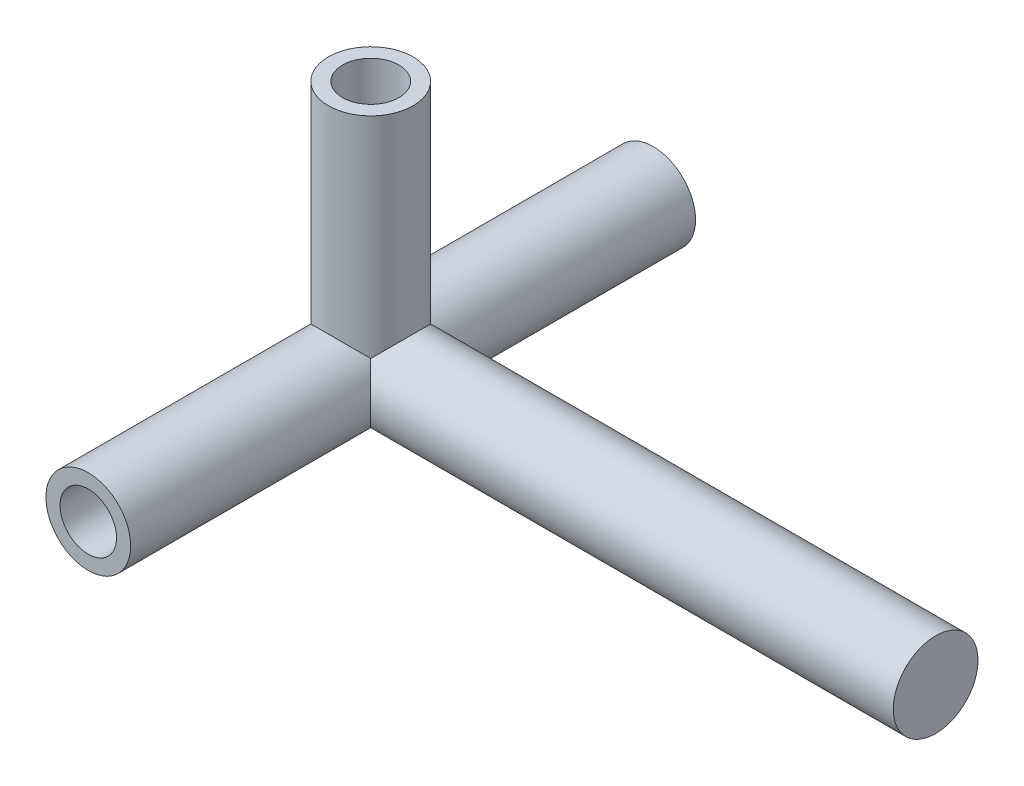
ISO-10303-21;
HEADER;
FILE_DESCRIPTION(('STEP AP214'),'2;1');
FILE_NAME('part.step','',(''),(''),'','','');
FILE_SCHEMA(('AUTOMOTIVE_DESIGN { 1 0 10303 214 1 1 1 1 }'));
ENDSEC;
DATA;
#1=APPLICATION_CONTEXT('core data for automotive mechanical design processes');
#2=APPLICATION_PROTOCOL_DEFINITION('international standard','automotive_design',2000,#1);
#3=PRODUCT_CONTEXT('',#1,'mechanical');
#4=PRODUCT('Part','Part','',(#3));
#5=PRODUCT_RELATED_PRODUCT_CATEGORY('part','',(#4));
#6=PRODUCT_DEFINITION_FORMATION('','',#4);
#7=PRODUCT_DEFINITION_CONTEXT('part definition',#1,'design');
#8=PRODUCT_DEFINITION('design','',#6,#7);
#9=PRODUCT_DEFINITION_SHAPE('','',#8);
#10=(LENGTH_UNIT() NAMED_UNIT(*) SI_UNIT(.MILLI.,.METRE.));
#11=(NAMED_UNIT(*) PLANE_ANGLE_UNIT() SI_UNIT($,.RADIAN.));
#12=(NAMED_UNIT(*) SI_UNIT($,.STERADIAN.) SOLID_ANGLE_UNIT());
#13=UNCERTAINTY_MEASURE_WITH_UNIT(LENGTH_MEASURE(1.E-05),#10,'distance_accuracy_value','');
#14=(GEOMETRIC_REPRESENTATION_CONTEXT(3) GLOBAL_UNCERTAINTY_ASSIGNED_CONTEXT((#13)) GLOBAL_UNIT_ASSIGNED_CONTEXT((#10,
#11,#12)) REPRESENTATION_CONTEXT('',''));
#15=CARTESIAN_POINT('',(0.,0.,0.));
#16=DIRECTION('',(0.,0.,1.));
#17=DIRECTION('',(1.,0.,0.));
#18=AXIS2_PLACEMENT_3D('',#15,#16,#17);
#19=CARTESIAN_POINT('',(0.,0.,0.));
#20=DIRECTION('',(0.,1.,0.));
#21=DIRECTION('',(0.,0.,1.));
#22=AXIS2_PLACEMENT_3D('',#19,#20,#21);
#23=CYLINDRICAL_SURFACE('',#22,3.75);
#24=CARTESIAN_POINT('',(0.,21.25,0.));
#25=DIRECTION('',(0.,1.,0.));
#26=DIRECTION('',(0.,0.,1.));
#27=AXIS2_PLACEMENT_3D('',#24,#25,#26);
#28=CIRCLE('',#27,3.75);
#29=CARTESIAN_POINT('',(0.,21.25,3.75));
#30=VERTEX_POINT('',#29);
#31=EDGE_CURVE('E90',#30,#30,#28,.T.);
#32=ORIENTED_EDGE('',*,*,#31,.F.);
#33=EDGE_LOOP('',(#32));
#34=FACE_BOUND('',#33,.T.);
#35=CARTESIAN_POINT('',(-3.75,0.,0.));
#36=CARTESIAN_POINT('',(-3.75000005696414,0.0492651044086286,0.0492680009212414));
#37=CARTESIAN_POINT('',(-3.74902907021602,0.0985208451068601,0.0985452437469612));
#38=CARTESIAN_POINT('',(-3.74538782347,0.190796713683162,0.190857540662846));
#39=CARTESIAN_POINT('',(-3.74294688985675,0.233821171485445,0.233897411757015));
#40=CARTESIAN_POINT('',(-3.73703721652419,0.31363592807218,0.313712226517568));
#41=CARTESIAN_POINT('',(-3.73376715536458,0.350431579680017,0.35049663495009));
#42=CARTESIAN_POINT('',(-3.726122894944,0.424096102558774,0.424126147192545));
#43=CARTESIAN_POINT('',(-3.72174502541787,0.460964804876989,0.460971040126408));
#44=CARTESIAN_POINT('',(-3.71187158805768,0.534697827970052,0.53469157791912));
#45=CARTESIAN_POINT('',(-3.70637339165174,0.571561930583614,0.571567088152237));
#46=CARTESIAN_POINT('',(-3.6927720337349,0.654266206528988,0.65429244869084));
#47=CARTESIAN_POINT('',(-3.6843607996952,0.70008181091256,0.700116612512116));
#48=CARTESIAN_POINT('',(-3.66632493155899,0.788944819945586,0.788985907362992));
#49=CARTESIAN_POINT('',(-3.65679630527391,0.832001702320655,0.83204110359386));
#50=CARTESIAN_POINT('',(-3.63680003370121,0.91534891192463,0.915373986542191));
#51=CARTESIAN_POINT('',(-3.62642340947263,0.955649792257126,0.955662891712826));
#52=CARTESIAN_POINT('',(-3.61037514585131,1.01392157643316,1.01392427106337));
#53=CARTESIAN_POINT('',(-3.60525818070808,1.03197151459823,1.03197195183686));
#54=CARTESIAN_POINT('',(-3.59212565298201,1.07699841601944,1.07699776123618));
#55=CARTESIAN_POINT('',(-3.5839346113681,1.10394872137761,1.10395149374499));
#56=CARTESIAN_POINT('',(-3.55979630353604,1.18025493343085,1.18026961389394));
#57=CARTESIAN_POINT('',(-3.54309342589352,1.22949156401108,1.22951655472359));
#58=CARTESIAN_POINT('',(-3.50822695142427,1.32561571525919,1.32565179071897));
#59=CARTESIAN_POINT('',(-3.49014836727552,1.37251850158599,1.37255571603895));
#60=CARTESIAN_POINT('',(-3.45275695616083,1.46397543746565,1.46400383029814));
#61=CARTESIAN_POINT('',(-3.43352663393972,1.50854619353767,1.50856508502321));
#62=CARTESIAN_POINT('',(-3.39960351961334,1.5831239210872,1.58312916114714));
#63=CARTESIAN_POINT('',(-3.38541706421284,1.6132467142968,1.6132470638075));
#64=CARTESIAN_POINT('',(-3.36326998582144,1.65867712348425,1.65867694392104));
#65=CARTESIAN_POINT('',(-3.35563623885017,1.67406650082733,1.67406734028622));
#66=CARTESIAN_POINT('',(-3.32195956540745,1.74079575420104,1.7408033237963));
#67=CARTESIAN_POINT('',(-3.29471530587043,1.79183374958423,1.79185242967148));
#68=CARTESIAN_POINT('',(-3.23853225529925,1.89141140091552,1.89144504666456));
#69=CARTESIAN_POINT('',(-3.20968411618505,1.93997656922923,1.94001430680212));
#70=CARTESIAN_POINT('',(-3.15051238614745,2.03460987469887,2.03464348035683));
#71=CARTESIAN_POINT('',(-3.12027748695937,2.0807054637192,2.08073127753851));
#72=CARTESIAN_POINT('',(-3.06022995504693,2.16794776631719,2.16795707451563));
#73=CARTESIAN_POINT('',(-3.03062499816281,2.20916598544501,2.20916672630975));
#74=CARTESIAN_POINT('',(-2.95997583900199,2.30336644149512,2.30336547325049));
#75=CARTESIAN_POINT('',(-2.9182094295892,2.35607665483365,2.35608808609079));
#76=CARTESIAN_POINT('',(-2.83483686692299,2.45558524172337,2.45561552598137));
#77=CARTESIAN_POINT('',(-2.79352020103568,2.50250469738374,2.50254185170817));
#78=CARTESIAN_POINT('',(-2.7092816758919,2.59341596094182,2.59345421054915));
#79=CARTESIAN_POINT('',(-2.66645849820647,2.63745325674227,2.63748614337717));
#80=CARTESIAN_POINT('',(-2.57191692566359,2.72994692057105,2.72996144662059));
#81=CARTESIAN_POINT('',(-2.5197803277977,2.77819117430127,2.77819176477021));
#82=CARTESIAN_POINT('',(-2.42367925347238,2.86206216266095,2.86206170282539));
#83=CARTESIAN_POINT('',(-2.38045866444403,2.89811900818962,2.89812618195946));
#84=CARTESIAN_POINT('',(-2.28353102138711,2.97529055075766,2.97531481676204));
#85=CARTESIAN_POINT('',(-2.22935825481965,3.01611436306911,3.01614816496907));
#86=CARTESIAN_POINT('',(-2.11948120849709,3.0942614003495,3.09430187866953));
#87=CARTESIAN_POINT('',(-2.06387548451463,3.13165371523667,3.13169170679968));
#88=CARTESIAN_POINT('',(-1.95136403680679,3.20293988618703,3.20296345022423));
#89=CARTESIAN_POINT('',(-1.8945503166884,3.23690582266653,3.23691773787602));
#90=CARTESIAN_POINT('',(-1.81268962262541,3.2828916196099,3.28289385828354));
#91=CARTESIAN_POINT('',(-1.78881363908494,3.29596587118859,3.29596610130166));
#92=CARTESIAN_POINT('',(-1.72768472973338,3.32856843279295,3.32856807941907));
#93=CARTESIAN_POINT('',(-1.69011700248035,3.34780255909453,3.34780604633606));
#94=CARTESIAN_POINT('',(-1.6199132085283,3.3822440792952,3.3822566948173));
#95=CARTESIAN_POINT('',(-1.58743106133501,3.39760892720343,3.39762650769383));
#96=CARTESIAN_POINT('',(-1.5221485769681,3.42733875318272,3.4273654108839));
#97=CARTESIAN_POINT('',(-1.48935761430029,3.44171400154419,3.44174478157651));
#98=CARTESIAN_POINT('',(-1.42349022483265,3.4694643671896,3.4695009574798));
#99=CARTESIAN_POINT('',(-1.3904224229716,3.4828497010425,3.4828880089039));
#100=CARTESIAN_POINT('',(-1.32403300493196,3.50862040064648,3.50865916733192));
#101=CARTESIAN_POINT('',(-1.29071926060263,3.52101588007005,3.52105342365669));
#102=CARTESIAN_POINT('',(-1.22386979660614,3.54480690597505,3.54483944600766));
#103=CARTESIAN_POINT('',(-1.19034118161118,3.55621241735959,3.55624120688901));
#104=CARTESIAN_POINT('',(-1.12309235782983,3.57802390520098,3.57804400042158));
#105=CARTESIAN_POINT('',(-1.08937849720085,3.58843964296071,3.58845480820637));
#106=CARTESIAN_POINT('',(-1.0334850246144,3.60484026816703,3.60484820269338));
#107=CARTESIAN_POINT('',(-1.01145760136248,3.61108592829215,3.61109124986102));
#108=CARTESIAN_POINT('',(-0.967343988430438,3.62315532717875,3.62315676170817));
#109=CARTESIAN_POINT('',(-0.945259203502762,3.62898163356011,3.6289817850729));
#110=CARTESIAN_POINT('',(-0.898184506810103,3.64093744320086,3.64093727317688));
#111=CARTESIAN_POINT('',(-0.87316931657594,3.64701702103839,3.64701810586868));
#112=CARTESIAN_POINT('',(-0.812267271284445,3.66115097272546,3.66115695529996));
#113=CARTESIAN_POINT('',(-0.77626203932694,3.66895151983626,3.66896193147555));
#114=CARTESIAN_POINT('',(-0.704078853333331,3.68347334310492,3.68349282196041));
#115=CARTESIAN_POINT('',(-0.667903655553754,3.69020147449638,3.69022558991067));
#116=CARTESIAN_POINT('',(-0.595412523714065,3.70257933018867,3.70261096175634));
#117=CARTESIAN_POINT('',(-0.559098699615238,3.70823521862722,3.70826974005508));
#118=CARTESIAN_POINT('',(-0.486363109637129,3.71846924246682,3.71850679096305));
#119=CARTESIAN_POINT('',(-0.449942872302424,3.72305279837389,3.72309049823145));
#120=CARTESIAN_POINT('',(-0.377026923391021,3.7311429328661,3.73117814348733));
#121=CARTESIAN_POINT('',(-0.340532240406409,3.73465413887728,3.73468672112188));
#122=CARTESIAN_POINT('',(-0.267499333397132,3.74060038612862,3.74062582235697));
#123=CARTESIAN_POINT('',(-0.230961728332945,3.74303921898608,3.74306014434292));
#124=CARTESIAN_POINT('',(-0.162003465600692,3.74662681811954,3.74663919924387));
#125=CARTESIAN_POINT('',(-0.129594827208816,3.74789207024376,3.74790042304461));
#126=CARTESIAN_POINT('',(-0.0647909890980053,3.7495779383839,3.74958009760598));
#127=CARTESIAN_POINT('',(-0.0323958659563368,3.75000003570645,3.75000002640965));
#128=CARTESIAN_POINT('',(0.0406738123534642,3.74999995516967,3.74999996684203));
#129=CARTESIAN_POINT('',(0.081348795637232,3.74933448412044,3.74933794044849));
#130=CARTESIAN_POINT('',(0.162711265517748,3.74667750814945,3.74668998750733));
#131=CARTESIAN_POINT('',(0.203398540482632,3.74468277182795,3.74470083474548));
#132=CARTESIAN_POINT('',(0.280590777380848,3.73964006266037,3.73966757272673));
#133=CARTESIAN_POINT('',(0.317111978290834,3.73671554869088,3.73674703774505));
#134=CARTESIAN_POINT('',(0.390098748173244,3.72979833989634,3.7298353805474));
#135=CARTESIAN_POINT('',(0.426563523152773,3.72580145796893,3.72584006163049));
#136=CARTESIAN_POINT('',(0.499405787458702,3.71674034673564,3.71677915921335));
#137=CARTESIAN_POINT('',(0.535782029158643,3.71167111335338,3.71170855767536));
#138=CARTESIAN_POINT('',(0.608415582249412,3.70046617108109,3.70049839222169));
#139=CARTESIAN_POINT('',(0.644671106891318,3.69432468741266,3.69435303973828));
#140=CARTESIAN_POINT('',(0.721499681835427,3.68015170012579,3.68017068385217));
#141=CARTESIAN_POINT('',(0.762020395708414,3.67197823379011,3.67199157097977));
#142=CARTESIAN_POINT('',(0.8428287510373,3.65429003627943,3.65429393567553));
#143=CARTESIAN_POINT('',(0.883111912437943,3.64476506770743,3.64476519109913));
#144=CARTESIAN_POINT('',(0.953009014913058,3.62701370400624,3.6270136115911));
#145=CARTESIAN_POINT('',(0.982762644139481,3.61906159775929,3.61906346181549));
#146=CARTESIAN_POINT('',(1.04216532301298,3.60240132901477,3.60240915869498));
#147=CARTESIAN_POINT('',(1.07181081562493,3.59368681276549,3.59369867055296));
#148=CARTESIAN_POINT('',(1.13515532475933,3.57421785984158,3.57423842839065));
#149=CARTESIAN_POINT('',(1.16878743837682,3.56335446384281,3.56337972168926));
#150=CARTESIAN_POINT('',(1.23586065677047,3.54064736155612,3.54068022350919));
#151=CARTESIAN_POINT('',(1.26929505778568,3.52879377360361,3.52882952922361));
#152=CARTESIAN_POINT('',(1.33594320327172,3.50410644174897,3.50414521715101));
#153=CARTESIAN_POINT('',(1.36914947990493,3.49126263921756,3.49130150709242));
#154=CARTESIAN_POINT('',(1.43531113713444,3.46459503082496,3.46463127301063));
#155=CARTESIAN_POINT('',(1.46825828783778,3.45076103979599,3.45079452891959));
#156=CARTESIAN_POINT('',(1.53387105502418,3.4221132461457,3.42213931452107));
#157=CARTESIAN_POINT('',(1.5665276892691,3.40728917933004,3.40731055599504));
#158=CARTESIAN_POINT('',(1.6315291429579,3.37666097053943,3.37667298733939));
#159=CARTESIAN_POINT('',(1.66386425210719,3.360846522745,3.36085387250667));
#160=CARTESIAN_POINT('',(1.71898104082796,3.33290681018757,3.33290849108013));
#161=CARTESIAN_POINT('',(1.74194611074827,3.32096205052374,3.32096207480398));
#162=CARTESIAN_POINT('',(1.80209121169545,3.28888472609755,3.28888468621469));
#163=CARTESIAN_POINT('',(1.83892261470837,3.26842312469092,3.26842744920741));
#164=CARTESIAN_POINT('',(1.93318315147287,3.21398047621671,3.21399855449695));
#165=CARTESIAN_POINT('',(1.98974004246518,3.17924065300827,3.17926956469801));
#166=CARTESIAN_POINT('',(2.10169260488723,3.10640313930782,3.10644306675496));
#167=CARTESIAN_POINT('',(2.15699460563083,3.06823390765803,3.06827366886457));
#168=CARTESIAN_POINT('',(2.26621441210246,2.98853038539422,2.98855936944147));
#169=CARTESIAN_POINT('',(2.32003206265389,2.94692764328556,2.94694568398575));
#170=CARTESIAN_POINT('',(2.40399673099899,2.87836070800951,2.87836497063765));
#171=CARTESIAN_POINT('',(2.43517847714392,2.85202610571121,2.85202603599869));
#172=CARTESIAN_POINT('',(2.48408924205272,2.80934026821942,2.80934031002606));
#173=CARTESIAN_POINT('',(2.50220682982481,2.79321254245752,2.79321420922931));
#174=CARTESIAN_POINT('',(2.56532435672543,2.73592414914515,2.73593468014428));
#175=CARTESIAN_POINT('',(2.60915942106844,2.69411720524635,2.69413975884659));
#176=CARTESIAN_POINT('',(2.65164079272559,2.65163100344863,2.65166006613849));
#177=B_SPLINE_CURVE_WITH_KNOTS('',3,(#35,#36,#37,#38,#39,#40,#41,#42,#43,#44,#45,#46,#47,#48,
#49,#50,#51,#52,#53,#54,#55,#56,#57,#58,#59,#60,#61,#62,#63,#64,#65,#66,#67,#68,#69,#70,#71,#72,
#73,#74,#75,#76,#77,#78,#79,#80,#81,#82,#83,#84,#85,#86,#87,#88,#89,#90,#91,#92,#93,#94,#95,#96,
#97,#98,#99,#100,#101,#102,#103,#104,#105,#106,#107,#108,#109,#110,#111,#112,#113,#114,#115,
#116,#117,#118,#119,#120,#121,#122,#123,#124,#125,#126,#127,#128,#129,#130,#131,#132,#133,#134,
#135,#136,#137,#138,#139,#140,#141,#142,#143,#144,#145,#146,#147,#148,#149,#150,#151,#152,#153,
#154,#155,#156,#157,#158,#159,#160,#161,#162,#163,#164,#165,#166,#167,#168,#169,#170,#171,#172,
#173,#174,#175,#176),.UNSPECIFIED.,.F.,.F.,(4,2,2,2,2,2,2,2,2,2,2,2,2,2,2,2,2,2,2,2,2,2,2,2,2,2,
2,2,2,2,2,2,2,2,2,2,2,2,2,2,2,2,2,2,2,2,2,2,2,2,2,2,2,2,2,2,2,2,2,2,2,2,2,2,2,2,2,2,2,2,4),(0.,
0.209013010606208,0.391711610491364,0.54809535473156,0.705004155118644,0.862285432569627,
1.05828902838872,1.24316413626235,1.41691330824867,1.49501020404251,1.61196359394082,
1.82676686672522,2.03298881699124,2.23064141307646,2.36532185409891,2.43451473455523,
2.66592523697649,2.88936742182358,3.10488011523542,3.30096333420067,3.55722673977379,
3.79165808154478,4.01831448518427,4.27575396442332,4.47623839143595,4.71363120559541,
4.94371257886952,5.16674580210977,5.25733155893554,5.39643986195544,5.51366399442944,
5.62938971867209,5.74367589419557,5.85658363187591,5.96817630721495,6.07851956165484,
6.14970824838163,6.2204155217264,6.2997615063322,6.41270468814688,6.52489412962593,
6.63641763858793,6.7473646039989,6.85782581450984,6.9678932607969,7.06524522106774,
7.16242599642038,7.28443886764243,7.40674943542269,7.51698183684263,7.62765107156968,
7.73884860393694,7.85066460185875,7.97703627413965,8.10442209193772,8.19982864722172,
8.29612408498225,8.40701962448158,8.5191972673486,8.63272163450756,8.74765507532809,
8.86405767494802,8.9819872729131,9.06750831010658,9.20798564866364,9.43257987963579,
9.66429500485444,9.90338879147941,10.0490905913957,10.1364680626481,10.3571754084457),.UNSPECIFIED.);
#178=CARTESIAN_POINT('',(-3.75,0.,0.));
#179=VERTEX_POINT('',#178);
#180=CARTESIAN_POINT('',(2.65164804080553,2.65164555241236,2.65165283539072));
#181=VERTEX_POINT('',#180);
#182=EDGE_CURVE('E95',#179,#181,#177,.T.);
#183=ORIENTED_EDGE('',*,*,#182,.T.);
#184=CARTESIAN_POINT('',(0.,0.,0.));
#185=DIRECTION('',(-0.707106781186547,0.707106781186547,0.));
#186=DIRECTION('',(0.707106781186547,0.707106781186547,0.));
#187=AXIS2_PLACEMENT_3D('',#184,#185,#186);
#188=ELLIPSE('',#187,5.3033008588991,3.75);
#189=CARTESIAN_POINT('',(2.65164796703623,2.6516454945143,-2.65165289379957));
#190=VERTEX_POINT('',#189);
#191=EDGE_CURVE('E88',#181,#190,#188,.T.);
#192=ORIENTED_EDGE('',*,*,#191,.T.);
#193=CARTESIAN_POINT('',(-3.75,0.,0.));
#194=CARTESIAN_POINT('',(-3.74999866233197,0.0625976578724673,-0.062567302120361));
#195=CARTESIAN_POINT('',(-3.7484327606687,0.125184098900291,-0.125148664971735));
#196=CARTESIAN_POINT('',(-3.74291742704495,0.235229655946013,-0.235203648692793));
#197=CARTESIAN_POINT('',(-3.7396315659887,0.282708025140869,-0.282692108057188));
#198=CARTESIAN_POINT('',(-3.73433631833122,0.342620874683701,-0.342617090697767));
#199=CARTESIAN_POINT('',(-3.73317096183665,0.355093786481453,-0.35509249554666));
#200=CARTESIAN_POINT('',(-3.72823902607277,0.405168538854984,-0.405172431617174));
#201=CARTESIAN_POINT('',(-3.72396355643764,0.442750777836765,-0.442747632518631));
#202=CARTESIAN_POINT('',(-3.71238870823259,0.532380062663686,-0.532367793423164));
#203=CARTESIAN_POINT('',(-3.70455949693801,0.584391880529819,-0.584380499215235));
#204=CARTESIAN_POINT('',(-3.69014606636502,0.668104128802892,-0.668100358791914));
#205=CARTESIAN_POINT('',(-3.68425481221325,0.699866174321038,-0.699866733400517));
#206=CARTESIAN_POINT('',(-3.67418516033899,0.750489680590761,-0.750489347479086));
#207=CARTESIAN_POINT('',(-3.67027685913621,0.76937662662485,-0.769374225084193));
#208=CARTESIAN_POINT('',(-3.65442845996129,0.84308903752999,-0.843072913059302));
#209=CARTESIAN_POINT('',(-3.64137741688503,0.897803070825188,-0.897764535201566));
#210=CARTESIAN_POINT('',(-3.61342901374009,1.00424611430218,-1.00417531900597));
#211=CARTESIAN_POINT('',(-3.59865182561631,1.05599125202041,-1.05591005187967));
#212=CARTESIAN_POINT('',(-3.56758500386075,1.15648637542333,-1.1564066179411));
#213=CARTESIAN_POINT('',(-3.55141067034493,1.20525472860262,-1.20518571271285));
#214=CARTESIAN_POINT('',(-3.51786603953404,1.29980703069115,-1.29977070010241));
#215=CARTESIAN_POINT('',(-3.50060630717846,1.34561083944958,-1.34559582130505));
#216=CARTESIAN_POINT('',(-3.47653733840992,1.40585786197663,-1.40585546363593));
#217=CARTESIAN_POINT('',(-3.47059268272728,1.42047030697127,-1.42046976377819));
#218=CARTESIAN_POINT('',(-3.45046874375608,1.46905381163704,-1.46905507691455));
#219=CARTESIAN_POINT('',(-3.43584785440486,1.50293688392707,-1.50293229609003));
#220=CARTESIAN_POINT('',(-3.39857086648314,1.58591531940096,-1.58589419446808));
#221=CARTESIAN_POINT('',(-3.37530044370337,1.63487381480236,-1.63484102101179));
#222=CARTESIAN_POINT('',(-3.32725114110687,1.73050964099939,-1.73046319972821));
#223=CARTESIAN_POINT('',(-3.30255237596231,1.77720726633729,-1.77715852494931));
#224=CARTESIAN_POINT('',(-3.25184669051605,1.86831827539859,-1.86827744079397));
#225=CARTESIAN_POINT('',(-3.22591807679358,1.91275364737582,-1.91272257559172));
#226=CARTESIAN_POINT('',(-3.17294533076948,1.99934946081279,-1.99933812782541));
#227=CARTESIAN_POINT('',(-3.1459777465269,2.04153331675595,-2.04153193856128));
#228=CARTESIAN_POINT('',(-3.08806085967803,2.128211922749,-2.12821339868956));
#229=CARTESIAN_POINT('',(-3.05696481052764,2.17265838001659,-2.17265149560018));
#230=CARTESIAN_POINT('',(-2.99337006625024,2.25943484116072,-2.25941314893836));
#231=CARTESIAN_POINT('',(-2.96093720886401,2.30178898146747,-2.30176079379626));
#232=CARTESIAN_POINT('',(-2.89482009131778,2.38437244491051,-2.38433926711156));
#233=CARTESIAN_POINT('',(-2.86120029465296,2.42462766977535,-2.42459576856218));
#234=CARTESIAN_POINT('',(-2.79285607766783,2.50301365509088,-2.50299132382923));
#235=CARTESIAN_POINT('',(-2.75819469557151,2.54117195266328,-2.54115770393017));
#236=CARTESIAN_POINT('',(-2.69932353022074,2.60332270560324,-2.60331892359571));
#237=CARTESIAN_POINT('',(-2.67570542246249,2.62759543873382,-2.62759504523991));
#238=CARTESIAN_POINT('',(-2.63897647982345,2.66432437786532,-2.66432458518701));
#239=CARTESIAN_POINT('',(-2.62618125252022,2.67693788181883,-2.67693746505618));
#240=CARTESIAN_POINT('',(-2.5751739847016,2.72649950504516,-2.72649510174033));
#241=CARTESIAN_POINT('',(-2.53602126585056,2.76296950464917,-2.76295877253489));
#242=CARTESIAN_POINT('',(-2.45660564630712,2.83378655749399,-2.83376620009096));
#243=CARTESIAN_POINT('',(-2.4163969456927,2.86816406699835,-2.86814033953149));
#244=CARTESIAN_POINT('',(-2.33499177422622,2.93479268982819,-2.93476874423969));
#245=CARTESIAN_POINT('',(-2.29384756432963,2.96707578250618,-2.96705482281055));
#246=CARTESIAN_POINT('',(-2.21068966367868,3.02951877116411,-3.02950723823972));
#247=CARTESIAN_POINT('',(-2.16872615819147,3.05971201198145,-3.05970682836925));
#248=CARTESIAN_POINT('',(-2.11178576404955,3.09889524767471,-3.09889434717376));
#249=CARTESIAN_POINT('',(-2.09763714865038,3.1084903217054,-3.10849014292622));
#250=CARTESIAN_POINT('',(-2.05394949004169,3.13768147418144,-3.1376818435507));
#251=CARTESIAN_POINT('',(-2.0240830635892,3.15703453193244,-3.15703295305459));
#252=CARTESIAN_POINT('',(-1.94919213076097,3.20404788510165,-3.20404011823841));
#253=CARTESIAN_POINT('',(-1.90367084686381,3.23131453185437,-3.2313018775662));
#254=CARTESIAN_POINT('',(-1.81182195981053,3.28367699190938,-3.28365842027722));
#255=CARTESIAN_POINT('',(-1.76553346523106,3.30880713498042,-3.3087874517925));
#256=CARTESIAN_POINT('',(-1.67225780366938,3.35689556458937,-3.35687859624991));
#257=CARTESIAN_POINT('',(-1.62530662856183,3.37988875546969,-3.37987550865978));
#258=CARTESIAN_POINT('',(-1.53081297470913,3.42370663599461,-3.42370164034552));
#259=CARTESIAN_POINT('',(-1.48330315479183,3.44456650494626,-3.44456602049214));
#260=CARTESIAN_POINT('',(-1.38641038538051,3.48470072845967,-3.48470121705335));
#261=CARTESIAN_POINT('',(-1.33701489925437,3.50396001210439,-3.50395689344164));
#262=CARTESIAN_POINT('',(-1.2376391409694,3.54026864174963,-3.54025843329778));
#263=CARTESIAN_POINT('',(-1.18768142898626,3.55734882363835,-3.55733513157955));
#264=CARTESIAN_POINT('',(-1.0872833939266,3.58929624292286,-3.58927960402326));
#265=CARTESIAN_POINT('',(-1.03686198659361,3.60419320285967,-3.60417704034744));
#266=CARTESIAN_POINT('',(-0.935635206965195,3.63177635099326,-3.63176467361889));
#267=CARTESIAN_POINT('',(-0.88484521055172,3.64449068754899,-3.64448296914651));
#268=CARTESIAN_POINT('',(-0.799784426881972,3.66388417551102,-3.6638819707916));
#269=CARTESIAN_POINT('',(-0.765777216001684,3.67114423862363,-3.6711439482658));
#270=CARTESIAN_POINT('',(-0.714366363455574,3.68137056178984,-3.6813707080566));
#271=CARTESIAN_POINT('',(-0.697098013170294,3.68467971900856,-3.68467959943389));
#272=CARTESIAN_POINT('',(-0.628138779899301,3.69739078223186,-3.69738855854722));
#273=CARTESIAN_POINT('',(-0.576095796049385,3.70586129568403,-3.70585516091795));
#274=CARTESIAN_POINT('',(-0.471768022127088,3.72057671654653,-3.72056447869469));
#275=CARTESIAN_POINT('',(-0.419487495914579,3.72683683392241,-3.72682239218819));
#276=CARTESIAN_POINT('',(-0.31477672572603,3.73713370014272,-3.73711879299985));
#277=CARTESIAN_POINT('',(-0.262348798307698,3.74118222299789,-3.74116903319452));
#278=CARTESIAN_POINT('',(-0.15743362897155,3.74706074557402,-3.74705319740221));
#279=CARTESIAN_POINT('',(-0.104947312995445,3.74889884314328,-3.74889521113034));
#280=CARTESIAN_POINT('',(-0.0349611636622735,3.74987781760115,-3.74987713127002));
#281=CARTESIAN_POINT('',(-0.0174808201547132,3.75000002547335,-3.74999988574815));
#282=CARTESIAN_POINT('',(0.0349654457020339,3.74999994904775,-3.75000022852857));
#283=CARTESIAN_POINT('',(0.0699327984077463,3.74951085827176,-3.74950978935619));
#284=CARTESIAN_POINT('',(0.157404237646867,3.74706349647386,-3.74705783987749));
#285=CARTESIAN_POINT('',(0.209875581836387,3.74448960333484,-3.74448009729229));
#286=CARTESIAN_POINT('',(0.31473720043038,3.73713999748872,-3.7371256953807));
#287=CARTESIAN_POINT('',(0.367126130122485,3.73235475893734,-3.73233952290563));
#288=CARTESIAN_POINT('',(0.471732785854062,3.72058531992878,-3.72057191936197));
#289=CARTESIAN_POINT('',(0.523947558606198,3.71358799106482,-3.71357738232555));
#290=CARTESIAN_POINT('',(0.628113417122391,3.69740085473274,-3.69739683459997));
#291=CARTESIAN_POINT('',(0.680059384320785,3.68819459496873,-3.68819437918067));
#292=CARTESIAN_POINT('',(0.782975343411087,3.66772339026925,-3.66772360545979));
#293=CARTESIAN_POINT('',(0.833947639526106,3.65646421653099,-3.65646107820171));
#294=CARTESIAN_POINT('',(0.935606868801838,3.63179190787523,-3.63178188721084));
#295=CARTESIAN_POINT('',(0.986280667267355,3.61835175471268,-3.61833820347806));
#296=CARTESIAN_POINT('',(1.08724953690919,3.58931590482621,-3.58929925888003));
#297=CARTESIAN_POINT('',(1.13752798008853,3.57369132190439,-3.57367517112687));
#298=CARTESIAN_POINT('',(1.23761361662665,3.54028809089932,-3.54027633559426));
#299=CARTESIAN_POINT('',(1.28740059465623,3.52247913397524,-3.52247133300937));
#300=CARTESIAN_POINT('',(1.3696697025506,3.49109818674759,-3.49109601549197));
#301=CARTESIAN_POINT('',(1.40253279489049,3.47802262495022,-3.47802245235255));
#302=CARTESIAN_POINT('',(1.45102921485717,3.45793478112658,-3.45793486584061));
#303=CARTESIAN_POINT('',(1.46691533409136,3.45122523962698,-3.45122496915308));
#304=CARTESIAN_POINT('',(1.53079782268182,3.42372564513826,-3.42372263714278));
#305=CARTESIAN_POINT('',(1.57812969729172,3.40215724475367,-3.40214919617899));
#306=CARTESIAN_POINT('',(1.67223511323506,3.35692034457842,-3.35690447453683));
#307=CARTESIAN_POINT('',(1.71897466171238,3.33321661319707,-3.33319801328565));
#308=CARTESIAN_POINT('',(1.81179767018526,3.28370472954131,-3.28368560625785));
#309=CARTESIAN_POINT('',(1.85784394315581,3.25786170139709,-3.257844894777));
#310=CARTESIAN_POINT('',(1.94917868016404,3.20407145546087,-3.20406194320823));
#311=CARTESIAN_POINT('',(1.99442691589726,3.17609002087076,-3.17608554490223));
#312=CARTESIAN_POINT('',(2.05372616031999,3.13767876322669,-3.13767802151505));
#313=CARTESIAN_POINT('',(2.06861090065355,3.12788504350041,-3.12788498872728));
#314=CARTESIAN_POINT('',(2.1120059084338,3.09888941024257,-3.09888951631427));
#315=CARTESIAN_POINT('',(2.14022116079324,3.0794667104606,-3.07946455180471));
#316=CARTESIAN_POINT('',(2.21067943708862,3.02954258266447,-3.029532949197));
#317=CARTESIAN_POINT('',(2.25237851923628,2.9986570275867,-2.99864125737597));
#318=CARTESIAN_POINT('',(2.33497426758154,2.93482393183602,-2.93480052742979));
#319=CARTESIAN_POINT('',(2.37581989307007,2.90184336927584,-2.90181859547974));
#320=CARTESIAN_POINT('',(2.45659156297439,2.83381713722966,-2.83379580317319));
#321=CARTESIAN_POINT('',(2.4964645019505,2.79873989760236,-2.79872353747459));
#322=CARTESIAN_POINT('',(2.57517025723898,2.72652233452493,-2.72651594728053));
#323=CARTESIAN_POINT('',(2.61394806355596,2.68935200935212,-2.6893506182745));
#324=CARTESIAN_POINT('',(2.65165043477573,2.65165042412338,-2.65165042412342));
#325=B_SPLINE_CURVE_WITH_KNOTS('',3,(#193,#194,#195,#196,#197,#198,#199,#200,#201,#202,#203,
#204,#205,#206,#207,#208,#209,#210,#211,#212,#213,#214,#215,#216,#217,#218,#219,#220,#221,#222,
#223,#224,#225,#226,#227,#228,#229,#230,#231,#232,#233,#234,#235,#236,#237,#238,#239,#240,#241,
#242,#243,#244,#245,#246,#247,#248,#249,#250,#251,#252,#253,#254,#255,#256,#257,#258,#259,#260,
#261,#262,#263,#264,#265,#266,#267,#268,#269,#270,#271,#272,#273,#274,#275,#276,#277,#278,#279,
#280,#281,#282,#283,#284,#285,#286,#287,#288,#289,#290,#291,#292,#293,#294,#295,#296,#297,#298,
#299,#300,#301,#302,#303,#304,#305,#306,#307,#308,#309,#310,#311,#312,#313,#314,#315,#316,#317,
#318,#319,#320,#321,#322,#323,#324),.UNSPECIFIED.,.F.,.F.,(4,2,2,2,2,2,2,2,2,2,2,2,2,2,2,2,2,2,
2,2,2,2,2,2,2,2,2,2,2,2,2,2,2,2,2,2,2,2,2,2,2,2,2,2,2,2,2,2,2,2,2,2,2,2,2,2,2,2,2,2,2,2,2,2,2,
4),(0.,0.265503648889039,0.467174008787312,0.520212526640648,0.680148053918812,
0.902027302659919,1.0379377966402,1.11891621541475,1.35423292228401,1.57814234526236,
1.79065242198213,1.99177246141527,2.05628519472654,2.20655682654706,2.42562102268857,
2.63710112825914,2.8410226454975,3.03741402281883,3.24773409228378,3.45202006780265,
3.65032343890526,3.84270049713989,3.96769386313676,4.03354961389041,4.22773863831972,
4.41694892756844,4.60127685223885,4.7808266450796,4.83963825253873,4.96114681015496,
5.14004535641571,5.31505050227893,5.48632086630113,5.65402566065078,5.8231634554231,
5.98955168718008,6.15340767455267,6.31495895119431,6.42150414425565,6.47517592057143,
6.63528456052328,6.79426896107093,6.95239850607505,7.10994696447621,7.16238861688724,
7.26728333771122,7.42497970250402,7.58336180290548,7.74270210310031,7.90326818343318,
8.06338964789804,8.22567203839005,8.39034957066915,8.55764639549431,8.67074609080794,
8.72625744458428,8.89510986503357,9.06759973791607,9.24389271976685,9.42414398179359,
9.48513760088792,9.60325569762637,9.78436826146928,9.9703099113509,10.1611821912769,
10.3570789769663),.UNSPECIFIED.);
#326=EDGE_CURVE('E132',#179,#190,#325,.T.);
#327=ORIENTED_EDGE('',*,*,#326,.F.);
#328=EDGE_LOOP('',(#183,#192,#327));
#329=FACE_BOUND('',#328,.T.);
#330=ADVANCED_FACE('F33',(#34,#329),#23,.T.);
#331=CARTESIAN_POINT('',(0.,0.,25.));
#332=DIRECTION('',(0.,0.,-1.));
#333=DIRECTION('',(-1.,0.,0.));
#334=AXIS2_PLACEMENT_3D('',#331,#332,#333);
#335=CYLINDRICAL_SURFACE('',#334,3.75);
#336=CARTESIAN_POINT('',(0.,0.,-25.));
#337=DIRECTION('',(0.,0.,1.));
#338=DIRECTION('',(1.,0.,0.));
#339=AXIS2_PLACEMENT_3D('',#336,#337,#338);
#340=CIRCLE('',#339,3.75);
#341=CARTESIAN_POINT('',(3.75,0.,-25.));
#342=VERTEX_POINT('',#341);
#343=EDGE_CURVE('E129',#342,#342,#340,.T.);
#344=ORIENTED_EDGE('',*,*,#343,.T.);
#345=EDGE_LOOP('',(#344));
#346=FACE_BOUND('',#345,.T.);
#347=CARTESIAN_POINT('',(0.,0.,25.));
#348=DIRECTION('',(0.,0.,1.));
#349=DIRECTION('',(1.,0.,0.));
#350=AXIS2_PLACEMENT_3D('',#347,#348,#349);
#351=CIRCLE('',#350,3.75);
#352=CARTESIAN_POINT('',(3.75,0.,25.));
#353=VERTEX_POINT('',#352);
#354=EDGE_CURVE('E121',#353,#353,#351,.T.);
#355=ORIENTED_EDGE('',*,*,#354,.F.);
#356=EDGE_LOOP('',(#355));
#357=FACE_BOUND('',#356,.T.);
#358=CARTESIAN_POINT('',(0.,0.,0.));
#359=DIRECTION('',(-0.707106781186547,0.,-0.707106781186547));
#360=DIRECTION('',(0.707106781186547,0.,-0.707106781186547));
#361=AXIS2_PLACEMENT_3D('',#358,#359,#360);
#362=ELLIPSE('',#361,5.30330085889911,3.75);
#363=CARTESIAN_POINT('',(0.,-3.75,0.));
#364=VERTEX_POINT('',#363);
#365=EDGE_CURVE('E11',#364,#190,#362,.F.);
#366=ORIENTED_EDGE('',*,*,#365,.F.);
#367=CARTESIAN_POINT('',(0.,0.,0.));
#368=DIRECTION('',(0.707106781186547,0.,-0.707106781186547));
#369=DIRECTION('',(-0.707106781186547,0.,-0.707106781186547));
#370=AXIS2_PLACEMENT_3D('',#367,#368,#369);
#371=ELLIPSE('',#370,5.30330085889911,3.75);
#372=EDGE_CURVE('E43',#181,#364,#371,.T.);
#373=ORIENTED_EDGE('',*,*,#372,.F.);
#374=ORIENTED_EDGE('',*,*,#182,.F.);
#375=ORIENTED_EDGE('',*,*,#326,.T.);
#376=EDGE_LOOP('',(#366,#373,#374,#375));
#377=FACE_BOUND('',#376,.T.);
#378=ADVANCED_FACE('F35',(#346,#357,#377),#335,.T.);
#379=CARTESIAN_POINT('',(0.,0.,25.));
#380=DIRECTION('',(0.,0.,1.));
#381=DIRECTION('',(1.,0.,0.));
#382=AXIS2_PLACEMENT_3D('',#379,#380,#381);
#383=PLANE('',#382);
#384=CARTESIAN_POINT('',(0.,0.,25.));
#385=DIRECTION('',(0.,0.,1.));
#386=DIRECTION('',(1.,0.,0.));
#387=AXIS2_PLACEMENT_3D('',#384,#385,#386);
#388=CIRCLE('',#387,2.5);
#389=CARTESIAN_POINT('',(2.5,0.,25.));
#390=VERTEX_POINT('',#389);
#391=EDGE_CURVE('E82',#390,#390,#388,.T.);
#392=ORIENTED_EDGE('',*,*,#391,.F.);
#393=EDGE_LOOP('',(#392));
#394=FACE_BOUND('',#393,.T.);
#395=ORIENTED_EDGE('',*,*,#354,.T.);
#396=EDGE_LOOP('',(#395));
#397=FACE_BOUND('',#396,.T.);
#398=ADVANCED_FACE('F116',(#394,#397),#383,.T.);
#399=CARTESIAN_POINT('',(0.,0.,-25.));
#400=DIRECTION('',(0.,0.,1.));
#401=DIRECTION('',(1.,0.,0.));
#402=AXIS2_PLACEMENT_3D('',#399,#400,#401);
#403=PLANE('',#402);
#404=CARTESIAN_POINT('',(0.,0.,-25.));
#405=DIRECTION('',(0.,0.,1.));
#406=DIRECTION('',(1.,0.,0.));
#407=AXIS2_PLACEMENT_3D('',#404,#405,#406);
#408=CIRCLE('',#407,2.5);
#409=CARTESIAN_POINT('',(2.5,0.,-25.));
#410=VERTEX_POINT('',#409);
#411=EDGE_CURVE('E77',#410,#410,#408,.T.);
#412=ORIENTED_EDGE('',*,*,#411,.T.);
#413=EDGE_LOOP('',(#412));
#414=FACE_BOUND('',#413,.T.);
#415=ORIENTED_EDGE('',*,*,#343,.F.);
#416=EDGE_LOOP('',(#415));
#417=FACE_BOUND('',#416,.T.);
#418=ADVANCED_FACE('F162',(#414,#417),#403,.F.);
#419=CARTESIAN_POINT('',(0.,21.25,0.));
#420=DIRECTION('',(0.,1.,0.));
#421=DIRECTION('',(0.,0.,1.));
#422=AXIS2_PLACEMENT_3D('',#419,#420,#421);
#423=PLANE('',#422);
#424=CARTESIAN_POINT('',(0.,21.25,0.));
#425=DIRECTION('',(0.,1.,0.));
#426=DIRECTION('',(0.,0.,1.));
#427=AXIS2_PLACEMENT_3D('',#424,#425,#426);
#428=CIRCLE('',#427,2.5);
#429=CARTESIAN_POINT('',(0.,21.25,2.5));
#430=VERTEX_POINT('',#429);
#431=EDGE_CURVE('E74',#430,#430,#428,.T.);
#432=ORIENTED_EDGE('',*,*,#431,.F.);
#433=EDGE_LOOP('',(#432));
#434=FACE_BOUND('',#433,.T.);
#435=ORIENTED_EDGE('',*,*,#31,.T.);
#436=EDGE_LOOP('',(#435));
#437=FACE_BOUND('',#436,.T.);
#438=ADVANCED_FACE('F114',(#434,#437),#423,.T.);
#439=CARTESIAN_POINT('',(50.,0.,0.));
#440=DIRECTION('',(-1.,0.,0.));
#441=DIRECTION('',(0.,0.,1.));
#442=AXIS2_PLACEMENT_3D('',#439,#440,#441);
#443=CYLINDRICAL_SURFACE('',#442,3.75);
#444=ORIENTED_EDGE('',*,*,#191,.F.);
#445=ORIENTED_EDGE('',*,*,#372,.T.);
#446=ORIENTED_EDGE('',*,*,#365,.T.);
#447=EDGE_LOOP('',(#444,#445,#446));
#448=FACE_BOUND('',#447,.T.);
#449=CARTESIAN_POINT('',(50.,0.,0.));
#450=DIRECTION('',(1.,0.,0.));
#451=DIRECTION('',(0.,0.,-1.));
#452=AXIS2_PLACEMENT_3D('',#449,#450,#451);
#453=CIRCLE('',#452,3.75);
#454=CARTESIAN_POINT('',(50.,0.,-3.75));
#455=VERTEX_POINT('',#454);
#456=EDGE_CURVE('E85',#455,#455,#453,.T.);
#457=ORIENTED_EDGE('',*,*,#456,.F.);
#458=EDGE_LOOP('',(#457));
#459=FACE_BOUND('',#458,.T.);
#460=ADVANCED_FACE('F155',(#448,#459),#443,.T.);
#461=CARTESIAN_POINT('',(50.,0.,0.));
#462=DIRECTION('',(1.,0.,0.));
#463=DIRECTION('',(0.,0.,-1.));
#464=AXIS2_PLACEMENT_3D('',#461,#462,#463);
#465=PLANE('',#464);
#466=ORIENTED_EDGE('',*,*,#456,.T.);
#467=EDGE_LOOP('',(#466));
#468=FACE_BOUND('',#467,.T.);
#469=ADVANCED_FACE('F178',(#468),#465,.T.);
#470=CARTESIAN_POINT('',(0.,0.,25.001));
#471=DIRECTION('',(0.,0.,-1.));
#472=DIRECTION('',(-1.,0.,0.));
#473=AXIS2_PLACEMENT_3D('',#470,#471,#472);
#474=CYLINDRICAL_SURFACE('',#473,2.5);
#475=CARTESIAN_POINT('',(0.,0.,0.));
#476=DIRECTION('',(0.,0.707106781186548,-0.707106781186547));
#477=DIRECTION('',(0.,0.707106781186547,0.707106781186547));
#478=AXIS2_PLACEMENT_3D('',#475,#476,#477);
#479=ELLIPSE('',#478,3.53553390593274,2.5);
#480=CARTESIAN_POINT('',(-2.5,0.,0.));
#481=VERTEX_POINT('',#480);
#482=CARTESIAN_POINT('',(2.5,0.,0.));
#483=VERTEX_POINT('',#482);
#484=EDGE_CURVE('E49',#481,#483,#479,.T.);
#485=ORIENTED_EDGE('',*,*,#484,.T.);
#486=CARTESIAN_POINT('',(0.,0.,0.));
#487=DIRECTION('',(0.,0.707106781186547,0.707106781186547));
#488=DIRECTION('',(0.,0.707106781186548,-0.707106781186547));
#489=AXIS2_PLACEMENT_3D('',#486,#487,#488);
#490=ELLIPSE('',#489,3.53553390593274,2.5);
#491=EDGE_CURVE('E67',#483,#481,#490,.T.);
#492=ORIENTED_EDGE('',*,*,#491,.T.);
#493=EDGE_LOOP('',(#485,#492));
#494=FACE_BOUND('',#493,.T.);
#495=ORIENTED_EDGE('',*,*,#391,.T.);
#496=EDGE_LOOP('',(#495));
#497=FACE_BOUND('',#496,.T.);
#498=ORIENTED_EDGE('',*,*,#411,.F.);
#499=EDGE_LOOP('',(#498));
#500=FACE_BOUND('',#499,.T.);
#501=ADVANCED_FACE('F72',(#494,#497,#500),#474,.F.);
#502=CARTESIAN_POINT('',(0.,-3.751025,0.));
#503=DIRECTION('',(0.,1.,0.));
#504=DIRECTION('',(0.,0.,1.));
#505=AXIS2_PLACEMENT_3D('',#502,#503,#504);
#506=CYLINDRICAL_SURFACE('',#505,2.5);
#507=ORIENTED_EDGE('',*,*,#491,.F.);
#508=ORIENTED_EDGE('',*,*,#484,.F.);
#509=EDGE_LOOP('',(#507,#508));
#510=FACE_BOUND('',#509,.T.);
#511=ORIENTED_EDGE('',*,*,#431,.T.);
#512=EDGE_LOOP('',(#511));
#513=FACE_BOUND('',#512,.T.);
#514=ADVANCED_FACE('F68',(#510,#513),#506,.F.);
#515=CLOSED_SHELL('',(#330,#378,#398,#418,#438,#460,#469,#501,#514));
#516=MANIFOLD_SOLID_BREP('B2',#515);
#517=ADVANCED_BREP_SHAPE_REPRESENTATION('',(#18,#516),#14);
#518=SHAPE_DEFINITION_REPRESENTATION(#9,#517);
ENDSEC;
END-ISO-10303-21;
